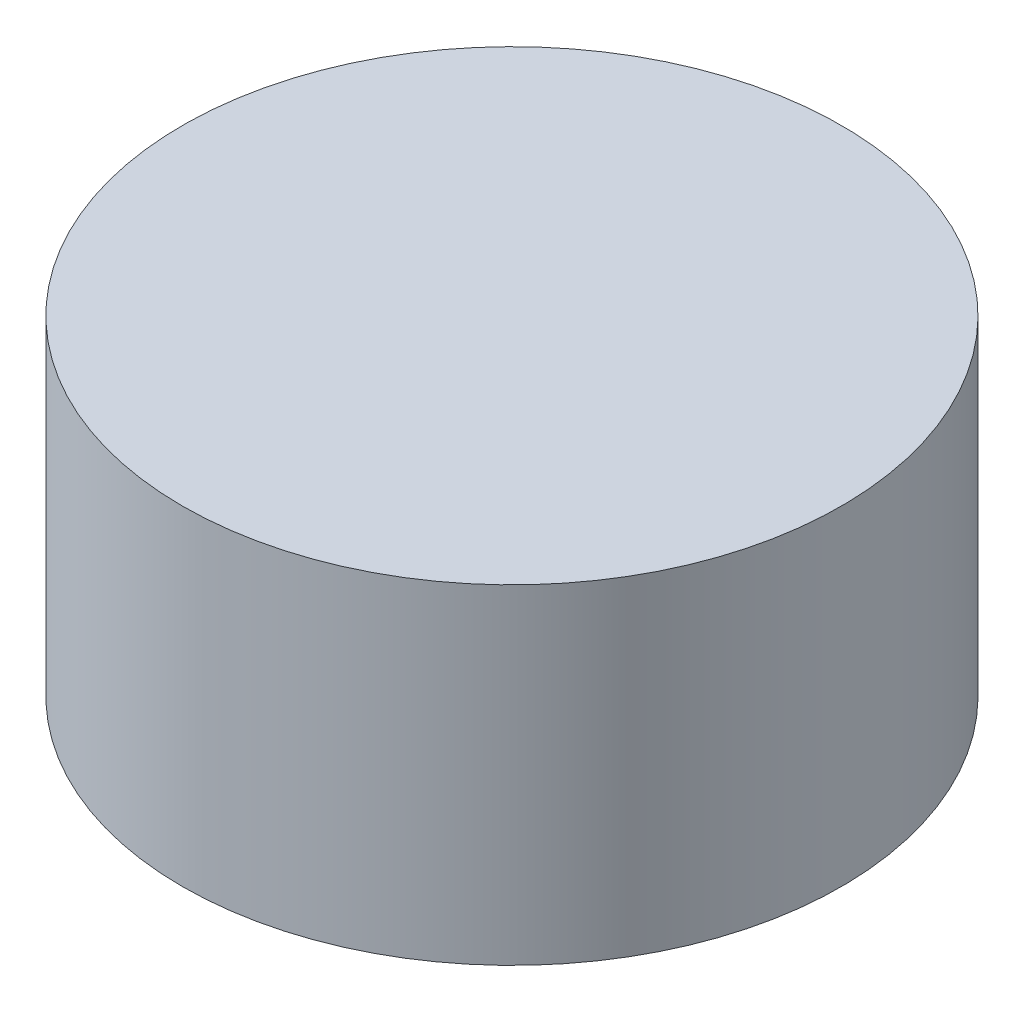
ISO-10303-21;
HEADER;
FILE_DESCRIPTION(('STEP AP214'),'2;1');
FILE_NAME('part.step','',(''),(''),'','','');
FILE_SCHEMA(('AUTOMOTIVE_DESIGN { 1 0 10303 214 1 1 1 1 }'));
ENDSEC;
DATA;
#1=APPLICATION_CONTEXT('core data for automotive mechanical design processes');
#2=APPLICATION_PROTOCOL_DEFINITION('international standard','automotive_design',2000,#1);
#3=PRODUCT_CONTEXT('',#1,'mechanical');
#4=PRODUCT('Part','Part','',(#3));
#5=PRODUCT_RELATED_PRODUCT_CATEGORY('part','',(#4));
#6=PRODUCT_DEFINITION_FORMATION('','',#4);
#7=PRODUCT_DEFINITION_CONTEXT('part definition',#1,'design');
#8=PRODUCT_DEFINITION('design','',#6,#7);
#9=PRODUCT_DEFINITION_SHAPE('','',#8);
#10=(LENGTH_UNIT() NAMED_UNIT(*) SI_UNIT(.MILLI.,.METRE.));
#11=(NAMED_UNIT(*) PLANE_ANGLE_UNIT() SI_UNIT($,.RADIAN.));
#12=(NAMED_UNIT(*) SI_UNIT($,.STERADIAN.) SOLID_ANGLE_UNIT());
#13=UNCERTAINTY_MEASURE_WITH_UNIT(LENGTH_MEASURE(1.E-05),#10,'distance_accuracy_value','');
#14=(GEOMETRIC_REPRESENTATION_CONTEXT(3) GLOBAL_UNCERTAINTY_ASSIGNED_CONTEXT((#13)) GLOBAL_UNIT_ASSIGNED_CONTEXT((#10,
#11,#12)) REPRESENTATION_CONTEXT('',''));
#15=CARTESIAN_POINT('',(0.,0.,0.));
#16=DIRECTION('',(0.,0.,1.));
#17=DIRECTION('',(1.,0.,0.));
#18=AXIS2_PLACEMENT_3D('',#15,#16,#17);
#19=CARTESIAN_POINT('',(-23.8809111171824,2.5,-21.8523731363346));
#20=DIRECTION('',(0.,-1.,0.));
#21=DIRECTION('',(0.,0.,-1.));
#22=AXIS2_PLACEMENT_3D('',#19,#20,#21);
#23=CYLINDRICAL_SURFACE('',#22,2.5);
#24=CARTESIAN_POINT('',(-23.8809111171824,2.5,-21.8523731363346));
#25=DIRECTION('',(0.,1.,0.));
#26=DIRECTION('',(0.,0.,1.));
#27=AXIS2_PLACEMENT_3D('',#24,#25,#26);
#28=CIRCLE('',#27,2.5);
#29=CARTESIAN_POINT('',(-23.8809111171824,2.5,-19.3523731363346));
#30=VERTEX_POINT('',#29);
#31=EDGE_CURVE('E10',#30,#30,#28,.T.);
#32=ORIENTED_EDGE('',*,*,#31,.F.);
#33=EDGE_LOOP('',(#32));
#34=FACE_BOUND('',#33,.T.);
#35=CARTESIAN_POINT('',(-23.8809111171824,0.,-21.8523731363346));
#36=DIRECTION('',(0.,1.,0.));
#37=DIRECTION('',(0.,0.,1.));
#38=AXIS2_PLACEMENT_3D('',#35,#36,#37);
#39=CIRCLE('',#38,2.5);
#40=CARTESIAN_POINT('',(-23.8809111171824,0.,-19.3523731363346));
#41=VERTEX_POINT('',#40);
#42=EDGE_CURVE('E36',#41,#41,#39,.T.);
#43=ORIENTED_EDGE('',*,*,#42,.T.);
#44=EDGE_LOOP('',(#43));
#45=FACE_BOUND('',#44,.T.);
#46=ADVANCED_FACE('F33',(#34,#45),#23,.T.);
#47=CARTESIAN_POINT('',(-23.8809111171824,2.5,-21.8523731363346));
#48=DIRECTION('',(0.,1.,0.));
#49=DIRECTION('',(0.,0.,1.));
#50=AXIS2_PLACEMENT_3D('',#47,#48,#49);
#51=PLANE('',#50);
#52=ORIENTED_EDGE('',*,*,#31,.T.);
#53=EDGE_LOOP('',(#52));
#54=FACE_BOUND('',#53,.T.);
#55=ADVANCED_FACE('F48',(#54),#51,.T.);
#56=CARTESIAN_POINT('',(-23.8809111171824,0.,-21.8523731363346));
#57=DIRECTION('',(0.,1.,0.));
#58=DIRECTION('',(0.,0.,1.));
#59=AXIS2_PLACEMENT_3D('',#56,#57,#58);
#60=PLANE('',#59);
#61=ORIENTED_EDGE('',*,*,#42,.F.);
#62=EDGE_LOOP('',(#61));
#63=FACE_BOUND('',#62,.T.);
#64=ADVANCED_FACE('F46',(#63),#60,.F.);
#65=CLOSED_SHELL('',(#46,#55,#64));
#66=MANIFOLD_SOLID_BREP('B2',#65);
#67=ADVANCED_BREP_SHAPE_REPRESENTATION('',(#18,#66),#14);
#68=SHAPE_DEFINITION_REPRESENTATION(#9,#67);
ENDSEC;
END-ISO-10303-21;
